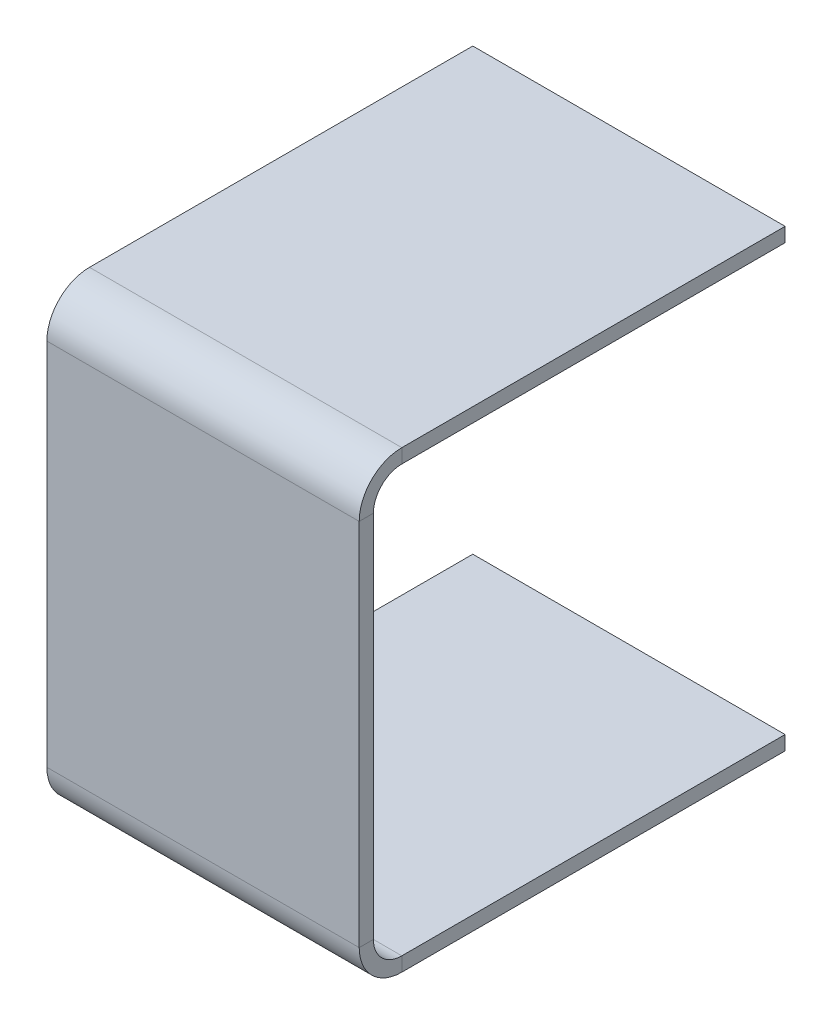
ISO-10303-21;
HEADER;
FILE_DESCRIPTION(('STEP AP214'),'2;1');
FILE_NAME('part.step','',(''),(''),'','','');
FILE_SCHEMA(('AUTOMOTIVE_DESIGN { 1 0 10303 214 1 1 1 1 }'));
ENDSEC;
DATA;
#1=APPLICATION_CONTEXT('core data for automotive mechanical design processes');
#2=APPLICATION_PROTOCOL_DEFINITION('international standard','automotive_design',2000,#1);
#3=PRODUCT_CONTEXT('',#1,'mechanical');
#4=PRODUCT('Part','Part','',(#3));
#5=PRODUCT_RELATED_PRODUCT_CATEGORY('part','',(#4));
#6=PRODUCT_DEFINITION_FORMATION('','',#4);
#7=PRODUCT_DEFINITION_CONTEXT('part definition',#1,'design');
#8=PRODUCT_DEFINITION('design','',#6,#7);
#9=PRODUCT_DEFINITION_SHAPE('','',#8);
#10=(LENGTH_UNIT() NAMED_UNIT(*) SI_UNIT(.MILLI.,.METRE.));
#11=(NAMED_UNIT(*) PLANE_ANGLE_UNIT() SI_UNIT($,.RADIAN.));
#12=(NAMED_UNIT(*) SI_UNIT($,.STERADIAN.) SOLID_ANGLE_UNIT());
#13=UNCERTAINTY_MEASURE_WITH_UNIT(LENGTH_MEASURE(1.E-05),#10,'distance_accuracy_value','');
#14=(GEOMETRIC_REPRESENTATION_CONTEXT(3) GLOBAL_UNCERTAINTY_ASSIGNED_CONTEXT((#13)) GLOBAL_UNIT_ASSIGNED_CONTEXT((#10,
#11,#12)) REPRESENTATION_CONTEXT('',''));
#15=CARTESIAN_POINT('',(0.,0.,0.));
#16=DIRECTION('',(0.,0.,1.));
#17=DIRECTION('',(1.,0.,0.));
#18=AXIS2_PLACEMENT_3D('',#15,#16,#17);
#19=CARTESIAN_POINT('',(0.,0.,0.));
#20=DIRECTION('',(0.,0.,-1.));
#21=DIRECTION('',(1.,0.,0.));
#22=AXIS2_PLACEMENT_3D('',#19,#20,#21);
#23=PLANE('',#22);
#24=DIRECTION('',(0.,-1.,0.));
#25=VECTOR('',#24,1.);
#26=CARTESIAN_POINT('',(11.,-16.,0.));
#27=LINE('',#26,#25);
#28=CARTESIAN_POINT('',(11.,-15.,0.));
#29=VERTEX_POINT('',#28);
#30=CARTESIAN_POINT('',(11.,-16.,0.));
#31=VERTEX_POINT('',#30);
#32=EDGE_CURVE('E154',#29,#31,#27,.T.);
#33=ORIENTED_EDGE('',*,*,#32,.T.);
#34=DIRECTION('',(-1.,0.,0.));
#35=VECTOR('',#34,1.);
#36=CARTESIAN_POINT('',(-11.,-16.,0.));
#37=LINE('',#36,#35);
#38=CARTESIAN_POINT('',(-11.,-16.,0.));
#39=VERTEX_POINT('',#38);
#40=EDGE_CURVE('E153',#31,#39,#37,.T.);
#41=ORIENTED_EDGE('',*,*,#40,.T.);
#42=DIRECTION('',(0.,1.,0.));
#43=VECTOR('',#42,1.);
#44=CARTESIAN_POINT('',(-11.,-16.,0.));
#45=LINE('',#44,#43);
#46=CARTESIAN_POINT('',(-11.,-15.,0.));
#47=VERTEX_POINT('',#46);
#48=EDGE_CURVE('E140',#39,#47,#45,.T.);
#49=ORIENTED_EDGE('',*,*,#48,.T.);
#50=DIRECTION('',(1.,0.,0.));
#51=VECTOR('',#50,1.);
#52=CARTESIAN_POINT('',(-11.,-15.,0.));
#53=LINE('',#52,#51);
#54=EDGE_CURVE('E150',#47,#29,#53,.T.);
#55=ORIENTED_EDGE('',*,*,#54,.T.);
#56=EDGE_LOOP('',(#33,#41,#49,#55));
#57=FACE_BOUND('',#56,.T.);
#58=ADVANCED_FACE('F32',(#57),#23,.T.);
#59=CARTESIAN_POINT('',(0.,0.,0.));
#60=DIRECTION('',(0.,0.,1.));
#61=DIRECTION('',(1.,0.,0.));
#62=AXIS2_PLACEMENT_3D('',#59,#60,#61);
#63=PLANE('',#62);
#64=DIRECTION('',(0.,1.,0.));
#65=VECTOR('',#64,1.);
#66=CARTESIAN_POINT('',(11.,16.,0.));
#67=LINE('',#66,#65);
#68=CARTESIAN_POINT('',(11.,15.,0.));
#69=VERTEX_POINT('',#68);
#70=CARTESIAN_POINT('',(11.,16.,0.));
#71=VERTEX_POINT('',#70);
#72=EDGE_CURVE('E46',#69,#71,#67,.T.);
#73=ORIENTED_EDGE('',*,*,#72,.F.);
#74=DIRECTION('',(1.,0.,0.));
#75=VECTOR('',#74,1.);
#76=CARTESIAN_POINT('',(-11.,15.,0.));
#77=LINE('',#76,#75);
#78=CARTESIAN_POINT('',(-11.,15.,0.));
#79=VERTEX_POINT('',#78);
#80=EDGE_CURVE('E55',#79,#69,#77,.T.);
#81=ORIENTED_EDGE('',*,*,#80,.F.);
#82=DIRECTION('',(0.,-1.,0.));
#83=VECTOR('',#82,1.);
#84=CARTESIAN_POINT('',(-11.,16.,0.));
#85=LINE('',#84,#83);
#86=CARTESIAN_POINT('',(-11.,16.,0.));
#87=VERTEX_POINT('',#86);
#88=EDGE_CURVE('E198',#87,#79,#85,.T.);
#89=ORIENTED_EDGE('',*,*,#88,.F.);
#90=DIRECTION('',(-1.,0.,0.));
#91=VECTOR('',#90,1.);
#92=CARTESIAN_POINT('',(-11.,16.,0.));
#93=LINE('',#92,#91);
#94=EDGE_CURVE('E11',#71,#87,#93,.T.);
#95=ORIENTED_EDGE('',*,*,#94,.F.);
#96=EDGE_LOOP('',(#73,#81,#89,#95));
#97=FACE_BOUND('',#96,.T.);
#98=ADVANCED_FACE('F302',(#97),#63,.F.);
#99=CARTESIAN_POINT('',(-11.,-16.,0.));
#100=DIRECTION('',(1.,0.,0.));
#101=DIRECTION('',(0.,0.,-1.));
#102=AXIS2_PLACEMENT_3D('',#99,#100,#101);
#103=PLANE('',#102);
#104=DIRECTION('',(0.,0.,1.));
#105=VECTOR('',#104,1.);
#106=CARTESIAN_POINT('',(-11.,-15.,0.));
#107=LINE('',#106,#105);
#108=CARTESIAN_POINT('',(-11.,-15.,27.));
#109=VERTEX_POINT('',#108);
#110=EDGE_CURVE('E147',#47,#109,#107,.T.);
#111=ORIENTED_EDGE('',*,*,#110,.F.);
#112=ORIENTED_EDGE('',*,*,#48,.F.);
#113=DIRECTION('',(0.,0.,1.));
#114=VECTOR('',#113,1.);
#115=CARTESIAN_POINT('',(-11.,-16.,0.));
#116=LINE('',#115,#114);
#117=CARTESIAN_POINT('',(-11.,-16.,27.));
#118=VERTEX_POINT('',#117);
#119=EDGE_CURVE('E145',#39,#118,#116,.T.);
#120=ORIENTED_EDGE('',*,*,#119,.T.);
#121=DIRECTION('',(0.,1.,0.));
#122=VECTOR('',#121,1.);
#123=CARTESIAN_POINT('',(-11.,-16.,27.));
#124=LINE('',#123,#122);
#125=EDGE_CURVE('E164',#118,#109,#124,.T.);
#126=ORIENTED_EDGE('',*,*,#125,.T.);
#127=EDGE_LOOP('',(#111,#112,#120,#126));
#128=FACE_BOUND('',#127,.T.);
#129=ADVANCED_FACE('F142',(#128),#103,.F.);
#130=CARTESIAN_POINT('',(-11.,-15.,0.));
#131=DIRECTION('',(0.,-1.,0.));
#132=DIRECTION('',(0.,0.,-1.));
#133=AXIS2_PLACEMENT_3D('',#130,#131,#132);
#134=PLANE('',#133);
#135=DIRECTION('',(0.,0.,1.));
#136=VECTOR('',#135,1.);
#137=CARTESIAN_POINT('',(11.,-15.,0.));
#138=LINE('',#137,#136);
#139=CARTESIAN_POINT('',(11.,-15.,27.));
#140=VERTEX_POINT('',#139);
#141=EDGE_CURVE('E209',#29,#140,#138,.T.);
#142=ORIENTED_EDGE('',*,*,#141,.F.);
#143=ORIENTED_EDGE('',*,*,#54,.F.);
#144=ORIENTED_EDGE('',*,*,#110,.T.);
#145=DIRECTION('',(1.,0.,0.));
#146=VECTOR('',#145,1.);
#147=CARTESIAN_POINT('',(-11.,-15.,27.));
#148=LINE('',#147,#146);
#149=EDGE_CURVE('E206',#109,#140,#148,.T.);
#150=ORIENTED_EDGE('',*,*,#149,.T.);
#151=EDGE_LOOP('',(#142,#143,#144,#150));
#152=FACE_BOUND('',#151,.T.);
#153=ADVANCED_FACE('F309',(#152),#134,.F.);
#154=CARTESIAN_POINT('',(11.,-16.,0.));
#155=DIRECTION('',(-1.,0.,0.));
#156=DIRECTION('',(0.,0.,1.));
#157=AXIS2_PLACEMENT_3D('',#154,#155,#156);
#158=PLANE('',#157);
#159=DIRECTION('',(0.,0.,1.));
#160=VECTOR('',#159,1.);
#161=CARTESIAN_POINT('',(11.,-16.,0.));
#162=LINE('',#161,#160);
#163=CARTESIAN_POINT('',(11.,-16.,27.));
#164=VERTEX_POINT('',#163);
#165=EDGE_CURVE('E233',#31,#164,#162,.T.);
#166=ORIENTED_EDGE('',*,*,#165,.F.);
#167=ORIENTED_EDGE('',*,*,#32,.F.);
#168=ORIENTED_EDGE('',*,*,#141,.T.);
#169=DIRECTION('',(0.,-1.,0.));
#170=VECTOR('',#169,1.);
#171=CARTESIAN_POINT('',(11.,-16.,27.));
#172=LINE('',#171,#170);
#173=EDGE_CURVE('E212',#140,#164,#172,.T.);
#174=ORIENTED_EDGE('',*,*,#173,.T.);
#175=EDGE_LOOP('',(#166,#167,#168,#174));
#176=FACE_BOUND('',#175,.T.);
#177=ADVANCED_FACE('F296',(#176),#158,.F.);
#178=CARTESIAN_POINT('',(-11.,-16.,0.));
#179=DIRECTION('',(0.,1.,0.));
#180=DIRECTION('',(0.,0.,1.));
#181=AXIS2_PLACEMENT_3D('',#178,#179,#180);
#182=PLANE('',#181);
#183=DIRECTION('',(-1.,0.,0.));
#184=VECTOR('',#183,1.);
#185=CARTESIAN_POINT('',(-11.,-16.,27.));
#186=LINE('',#185,#184);
#187=EDGE_CURVE('E162',#164,#118,#186,.T.);
#188=ORIENTED_EDGE('',*,*,#187,.T.);
#189=ORIENTED_EDGE('',*,*,#119,.F.);
#190=ORIENTED_EDGE('',*,*,#40,.F.);
#191=ORIENTED_EDGE('',*,*,#165,.T.);
#192=EDGE_LOOP('',(#188,#189,#190,#191));
#193=FACE_BOUND('',#192,.T.);
#194=ADVANCED_FACE('F160',(#193),#182,.F.);
#195=CARTESIAN_POINT('',(-11.,-16.,27.));
#196=DIRECTION('',(1.,0.,0.));
#197=DIRECTION('',(0.,0.,-1.));
#198=AXIS2_PLACEMENT_3D('',#195,#196,#197);
#199=PLANE('',#198);
#200=CARTESIAN_POINT('',(-11.,-13.,27.));
#201=DIRECTION('',(-1.,0.,0.));
#202=DIRECTION('',(0.,-1.,0.));
#203=AXIS2_PLACEMENT_3D('',#200,#201,#202);
#204=CIRCLE('',#203,2.);
#205=CARTESIAN_POINT('',(-11.,-13.,29.));
#206=VERTEX_POINT('',#205);
#207=EDGE_CURVE('E172',#109,#206,#204,.T.);
#208=ORIENTED_EDGE('',*,*,#207,.F.);
#209=ORIENTED_EDGE('',*,*,#125,.F.);
#210=CARTESIAN_POINT('',(-11.,-13.,27.));
#211=DIRECTION('',(-1.,0.,0.));
#212=DIRECTION('',(0.,-1.,0.));
#213=AXIS2_PLACEMENT_3D('',#210,#211,#212);
#214=CIRCLE('',#213,3.);
#215=CARTESIAN_POINT('',(-11.,-13.,30.));
#216=VERTEX_POINT('',#215);
#217=EDGE_CURVE('E173',#118,#216,#214,.T.);
#218=ORIENTED_EDGE('',*,*,#217,.T.);
#219=DIRECTION('',(0.,0.,-1.));
#220=VECTOR('',#219,1.);
#221=CARTESIAN_POINT('',(-11.,-13.,30.));
#222=LINE('',#221,#220);
#223=EDGE_CURVE('E169',#216,#206,#222,.T.);
#224=ORIENTED_EDGE('',*,*,#223,.T.);
#225=EDGE_LOOP('',(#208,#209,#218,#224));
#226=FACE_BOUND('',#225,.T.);
#227=ADVANCED_FACE('F295',(#226),#199,.F.);
#228=CARTESIAN_POINT('',(0.,-13.,27.));
#229=DIRECTION('',(-1.,0.,0.));
#230=DIRECTION('',(0.,0.,1.));
#231=AXIS2_PLACEMENT_3D('',#228,#229,#230);
#232=CYLINDRICAL_SURFACE('',#231,2.);
#233=CARTESIAN_POINT('',(11.,-13.,27.));
#234=DIRECTION('',(-1.,0.,0.));
#235=DIRECTION('',(0.,-1.,0.));
#236=AXIS2_PLACEMENT_3D('',#233,#234,#235);
#237=CIRCLE('',#236,2.);
#238=CARTESIAN_POINT('',(11.,-13.,29.));
#239=VERTEX_POINT('',#238);
#240=EDGE_CURVE('E215',#140,#239,#237,.T.);
#241=ORIENTED_EDGE('',*,*,#240,.F.);
#242=ORIENTED_EDGE('',*,*,#149,.F.);
#243=ORIENTED_EDGE('',*,*,#207,.T.);
#244=DIRECTION('',(1.,0.,0.));
#245=VECTOR('',#244,1.);
#246=CARTESIAN_POINT('',(-11.,-13.,29.));
#247=LINE('',#246,#245);
#248=EDGE_CURVE('E176',#206,#239,#247,.T.);
#249=ORIENTED_EDGE('',*,*,#248,.T.);
#250=EDGE_LOOP('',(#241,#242,#243,#249));
#251=FACE_BOUND('',#250,.T.);
#252=ADVANCED_FACE('F318',(#251),#232,.F.);
#253=CARTESIAN_POINT('',(11.,-16.,27.));
#254=DIRECTION('',(-1.,0.,0.));
#255=DIRECTION('',(0.,0.,1.));
#256=AXIS2_PLACEMENT_3D('',#253,#254,#255);
#257=PLANE('',#256);
#258=CARTESIAN_POINT('',(11.,-13.,27.));
#259=DIRECTION('',(-1.,0.,0.));
#260=DIRECTION('',(0.,-1.,0.));
#261=AXIS2_PLACEMENT_3D('',#258,#259,#260);
#262=CIRCLE('',#261,3.);
#263=CARTESIAN_POINT('',(11.,-13.,30.));
#264=VERTEX_POINT('',#263);
#265=EDGE_CURVE('E237',#164,#264,#262,.T.);
#266=ORIENTED_EDGE('',*,*,#265,.F.);
#267=ORIENTED_EDGE('',*,*,#173,.F.);
#268=ORIENTED_EDGE('',*,*,#240,.T.);
#269=DIRECTION('',(0.,0.,1.));
#270=VECTOR('',#269,1.);
#271=CARTESIAN_POINT('',(11.,-13.,30.));
#272=LINE('',#271,#270);
#273=EDGE_CURVE('E218',#239,#264,#272,.T.);
#274=ORIENTED_EDGE('',*,*,#273,.T.);
#275=EDGE_LOOP('',(#266,#267,#268,#274));
#276=FACE_BOUND('',#275,.T.);
#277=ADVANCED_FACE('F274',(#276),#257,.F.);
#278=CARTESIAN_POINT('',(0.,-13.,27.));
#279=DIRECTION('',(-1.,0.,0.));
#280=DIRECTION('',(0.,0.,1.));
#281=AXIS2_PLACEMENT_3D('',#278,#279,#280);
#282=CYLINDRICAL_SURFACE('',#281,3.);
#283=DIRECTION('',(-1.,0.,0.));
#284=VECTOR('',#283,1.);
#285=CARTESIAN_POINT('',(-11.,-13.,30.));
#286=LINE('',#285,#284);
#287=EDGE_CURVE('E189',#264,#216,#286,.T.);
#288=ORIENTED_EDGE('',*,*,#287,.T.);
#289=ORIENTED_EDGE('',*,*,#217,.F.);
#290=ORIENTED_EDGE('',*,*,#187,.F.);
#291=ORIENTED_EDGE('',*,*,#265,.T.);
#292=EDGE_LOOP('',(#288,#289,#290,#291));
#293=FACE_BOUND('',#292,.T.);
#294=ADVANCED_FACE('F270',(#293),#282,.T.);
#295=CARTESIAN_POINT('',(-11.,-13.,30.));
#296=DIRECTION('',(1.,0.,0.));
#297=DIRECTION('',(0.,0.,-1.));
#298=AXIS2_PLACEMENT_3D('',#295,#296,#297);
#299=PLANE('',#298);
#300=DIRECTION('',(0.,1.,0.));
#301=VECTOR('',#300,1.);
#302=CARTESIAN_POINT('',(-11.,-13.,29.));
#303=LINE('',#302,#301);
#304=CARTESIAN_POINT('',(-11.,13.,29.));
#305=VERTEX_POINT('',#304);
#306=EDGE_CURVE('E182',#206,#305,#303,.T.);
#307=ORIENTED_EDGE('',*,*,#306,.F.);
#308=ORIENTED_EDGE('',*,*,#223,.F.);
#309=DIRECTION('',(0.,1.,0.));
#310=VECTOR('',#309,1.);
#311=CARTESIAN_POINT('',(-11.,-13.,30.));
#312=LINE('',#311,#310);
#313=CARTESIAN_POINT('',(-11.,13.,30.));
#314=VERTEX_POINT('',#313);
#315=EDGE_CURVE('E183',#216,#314,#312,.T.);
#316=ORIENTED_EDGE('',*,*,#315,.T.);
#317=DIRECTION('',(0.,0.,-1.));
#318=VECTOR('',#317,1.);
#319=CARTESIAN_POINT('',(-11.,13.,30.));
#320=LINE('',#319,#318);
#321=EDGE_CURVE('E179',#314,#305,#320,.T.);
#322=ORIENTED_EDGE('',*,*,#321,.T.);
#323=EDGE_LOOP('',(#307,#308,#316,#322));
#324=FACE_BOUND('',#323,.T.);
#325=ADVANCED_FACE('F265',(#324),#299,.F.);
#326=CARTESIAN_POINT('',(-11.,-13.,29.));
#327=DIRECTION('',(0.,0.,1.));
#328=DIRECTION('',(1.,0.,0.));
#329=AXIS2_PLACEMENT_3D('',#326,#327,#328);
#330=PLANE('',#329);
#331=DIRECTION('',(0.,1.,0.));
#332=VECTOR('',#331,1.);
#333=CARTESIAN_POINT('',(11.,-13.,29.));
#334=LINE('',#333,#332);
#335=CARTESIAN_POINT('',(11.,13.,29.));
#336=VERTEX_POINT('',#335);
#337=EDGE_CURVE('E221',#239,#336,#334,.T.);
#338=ORIENTED_EDGE('',*,*,#337,.F.);
#339=ORIENTED_EDGE('',*,*,#248,.F.);
#340=ORIENTED_EDGE('',*,*,#306,.T.);
#341=DIRECTION('',(1.,0.,0.));
#342=VECTOR('',#341,1.);
#343=CARTESIAN_POINT('',(-11.,13.,29.));
#344=LINE('',#343,#342);
#345=EDGE_CURVE('E186',#305,#336,#344,.T.);
#346=ORIENTED_EDGE('',*,*,#345,.T.);
#347=EDGE_LOOP('',(#338,#339,#340,#346));
#348=FACE_BOUND('',#347,.T.);
#349=ADVANCED_FACE('F315',(#348),#330,.F.);
#350=CARTESIAN_POINT('',(11.,-13.,30.));
#351=DIRECTION('',(-1.,0.,0.));
#352=DIRECTION('',(0.,0.,1.));
#353=AXIS2_PLACEMENT_3D('',#350,#351,#352);
#354=PLANE('',#353);
#355=DIRECTION('',(0.,1.,0.));
#356=VECTOR('',#355,1.);
#357=CARTESIAN_POINT('',(11.,-13.,30.));
#358=LINE('',#357,#356);
#359=CARTESIAN_POINT('',(11.,13.,30.));
#360=VERTEX_POINT('',#359);
#361=EDGE_CURVE('E242',#264,#360,#358,.T.);
#362=ORIENTED_EDGE('',*,*,#361,.F.);
#363=ORIENTED_EDGE('',*,*,#273,.F.);
#364=ORIENTED_EDGE('',*,*,#337,.T.);
#365=DIRECTION('',(0.,0.,1.));
#366=VECTOR('',#365,1.);
#367=CARTESIAN_POINT('',(11.,13.,30.));
#368=LINE('',#367,#366);
#369=EDGE_CURVE('E224',#336,#360,#368,.T.);
#370=ORIENTED_EDGE('',*,*,#369,.T.);
#371=EDGE_LOOP('',(#362,#363,#364,#370));
#372=FACE_BOUND('',#371,.T.);
#373=ADVANCED_FACE('F276',(#372),#354,.F.);
#374=CARTESIAN_POINT('',(-11.,-13.,30.));
#375=DIRECTION('',(0.,0.,-1.));
#376=DIRECTION('',(-1.,0.,0.));
#377=AXIS2_PLACEMENT_3D('',#374,#375,#376);
#378=PLANE('',#377);
#379=DIRECTION('',(-1.,0.,0.));
#380=VECTOR('',#379,1.);
#381=CARTESIAN_POINT('',(-11.,13.,30.));
#382=LINE('',#381,#380);
#383=EDGE_CURVE('E197',#360,#314,#382,.T.);
#384=ORIENTED_EDGE('',*,*,#383,.T.);
#385=ORIENTED_EDGE('',*,*,#315,.F.);
#386=ORIENTED_EDGE('',*,*,#287,.F.);
#387=ORIENTED_EDGE('',*,*,#361,.T.);
#388=EDGE_LOOP('',(#384,#385,#386,#387));
#389=FACE_BOUND('',#388,.T.);
#390=ADVANCED_FACE('F268',(#389),#378,.F.);
#391=CARTESIAN_POINT('',(-11.,13.,30.));
#392=DIRECTION('',(1.,0.,0.));
#393=DIRECTION('',(0.,0.,-1.));
#394=AXIS2_PLACEMENT_3D('',#391,#392,#393);
#395=PLANE('',#394);
#396=CARTESIAN_POINT('',(-11.,13.,27.));
#397=DIRECTION('',(-1.,0.,0.));
#398=DIRECTION('',(0.,0.,1.));
#399=AXIS2_PLACEMENT_3D('',#396,#397,#398);
#400=CIRCLE('',#399,2.);
#401=CARTESIAN_POINT('',(-11.,15.,27.));
#402=VERTEX_POINT('',#401);
#403=EDGE_CURVE('E120',#305,#402,#400,.T.);
#404=ORIENTED_EDGE('',*,*,#403,.F.);
#405=ORIENTED_EDGE('',*,*,#321,.F.);
#406=CARTESIAN_POINT('',(-11.,13.,27.));
#407=DIRECTION('',(-1.,0.,0.));
#408=DIRECTION('',(0.,0.,1.));
#409=AXIS2_PLACEMENT_3D('',#406,#407,#408);
#410=CIRCLE('',#409,3.);
#411=CARTESIAN_POINT('',(-11.,16.,27.));
#412=VERTEX_POINT('',#411);
#413=EDGE_CURVE('E192',#314,#412,#410,.T.);
#414=ORIENTED_EDGE('',*,*,#413,.T.);
#415=DIRECTION('',(0.,-1.,0.));
#416=VECTOR('',#415,1.);
#417=CARTESIAN_POINT('',(-11.,16.,27.));
#418=LINE('',#417,#416);
#419=EDGE_CURVE('E190',#412,#402,#418,.T.);
#420=ORIENTED_EDGE('',*,*,#419,.T.);
#421=EDGE_LOOP('',(#404,#405,#414,#420));
#422=FACE_BOUND('',#421,.T.);
#423=ADVANCED_FACE('F262',(#422),#395,.F.);
#424=CARTESIAN_POINT('',(0.,13.,27.));
#425=DIRECTION('',(-1.,0.,0.));
#426=DIRECTION('',(0.,0.,1.));
#427=AXIS2_PLACEMENT_3D('',#424,#425,#426);
#428=CYLINDRICAL_SURFACE('',#427,2.);
#429=CARTESIAN_POINT('',(11.,13.,27.));
#430=DIRECTION('',(-1.,0.,0.));
#431=DIRECTION('',(0.,0.,1.));
#432=AXIS2_PLACEMENT_3D('',#429,#430,#431);
#433=CIRCLE('',#432,2.);
#434=CARTESIAN_POINT('',(11.,15.,27.));
#435=VERTEX_POINT('',#434);
#436=EDGE_CURVE('E113',#336,#435,#433,.T.);
#437=ORIENTED_EDGE('',*,*,#436,.F.);
#438=ORIENTED_EDGE('',*,*,#345,.F.);
#439=ORIENTED_EDGE('',*,*,#403,.T.);
#440=DIRECTION('',(1.,0.,0.));
#441=VECTOR('',#440,1.);
#442=CARTESIAN_POINT('',(-11.,15.,27.));
#443=LINE('',#442,#441);
#444=EDGE_CURVE('E194',#402,#435,#443,.T.);
#445=ORIENTED_EDGE('',*,*,#444,.T.);
#446=EDGE_LOOP('',(#437,#438,#439,#445));
#447=FACE_BOUND('',#446,.T.);
#448=ADVANCED_FACE('F312',(#447),#428,.F.);
#449=CARTESIAN_POINT('',(11.,13.,30.));
#450=DIRECTION('',(-1.,0.,0.));
#451=DIRECTION('',(0.,0.,1.));
#452=AXIS2_PLACEMENT_3D('',#449,#450,#451);
#453=PLANE('',#452);
#454=CARTESIAN_POINT('',(11.,13.,27.));
#455=DIRECTION('',(-1.,0.,0.));
#456=DIRECTION('',(0.,0.,1.));
#457=AXIS2_PLACEMENT_3D('',#454,#455,#456);
#458=CIRCLE('',#457,3.);
#459=CARTESIAN_POINT('',(11.,16.,27.));
#460=VERTEX_POINT('',#459);
#461=EDGE_CURVE('E247',#360,#460,#458,.T.);
#462=ORIENTED_EDGE('',*,*,#461,.F.);
#463=ORIENTED_EDGE('',*,*,#369,.F.);
#464=ORIENTED_EDGE('',*,*,#436,.T.);
#465=DIRECTION('',(0.,1.,0.));
#466=VECTOR('',#465,1.);
#467=CARTESIAN_POINT('',(11.,16.,27.));
#468=LINE('',#467,#466);
#469=EDGE_CURVE('E227',#435,#460,#468,.T.);
#470=ORIENTED_EDGE('',*,*,#469,.T.);
#471=EDGE_LOOP('',(#462,#463,#464,#470));
#472=FACE_BOUND('',#471,.T.);
#473=ADVANCED_FACE('F278',(#472),#453,.F.);
#474=CARTESIAN_POINT('',(0.,13.,27.));
#475=DIRECTION('',(-1.,0.,0.));
#476=DIRECTION('',(0.,0.,1.));
#477=AXIS2_PLACEMENT_3D('',#474,#475,#476);
#478=CYLINDRICAL_SURFACE('',#477,3.);
#479=DIRECTION('',(-1.,0.,0.));
#480=VECTOR('',#479,1.);
#481=CARTESIAN_POINT('',(-11.,16.,27.));
#482=LINE('',#481,#480);
#483=EDGE_CURVE('E204',#460,#412,#482,.T.);
#484=ORIENTED_EDGE('',*,*,#483,.T.);
#485=ORIENTED_EDGE('',*,*,#413,.F.);
#486=ORIENTED_EDGE('',*,*,#383,.F.);
#487=ORIENTED_EDGE('',*,*,#461,.T.);
#488=EDGE_LOOP('',(#484,#485,#486,#487));
#489=FACE_BOUND('',#488,.T.);
#490=ADVANCED_FACE('F258',(#489),#478,.T.);
#491=CARTESIAN_POINT('',(-11.,16.,27.));
#492=DIRECTION('',(1.,0.,0.));
#493=DIRECTION('',(0.,0.,-1.));
#494=AXIS2_PLACEMENT_3D('',#491,#492,#493);
#495=PLANE('',#494);
#496=DIRECTION('',(0.,0.,-1.));
#497=VECTOR('',#496,1.);
#498=CARTESIAN_POINT('',(-11.,15.,27.));
#499=LINE('',#498,#497);
#500=EDGE_CURVE('E94',#402,#79,#499,.T.);
#501=ORIENTED_EDGE('',*,*,#500,.F.);
#502=ORIENTED_EDGE('',*,*,#419,.F.);
#503=DIRECTION('',(0.,0.,-1.));
#504=VECTOR('',#503,1.);
#505=CARTESIAN_POINT('',(-11.,16.,27.));
#506=LINE('',#505,#504);
#507=EDGE_CURVE('E200',#412,#87,#506,.T.);
#508=ORIENTED_EDGE('',*,*,#507,.T.);
#509=ORIENTED_EDGE('',*,*,#88,.T.);
#510=EDGE_LOOP('',(#501,#502,#508,#509));
#511=FACE_BOUND('',#510,.T.);
#512=ADVANCED_FACE('F261',(#511),#495,.F.);
#513=CARTESIAN_POINT('',(-11.,15.,27.));
#514=DIRECTION('',(0.,1.,0.));
#515=DIRECTION('',(0.,0.,1.));
#516=AXIS2_PLACEMENT_3D('',#513,#514,#515);
#517=PLANE('',#516);
#518=DIRECTION('',(0.,0.,-1.));
#519=VECTOR('',#518,1.);
#520=CARTESIAN_POINT('',(11.,15.,27.));
#521=LINE('',#520,#519);
#522=EDGE_CURVE('E89',#435,#69,#521,.T.);
#523=ORIENTED_EDGE('',*,*,#522,.F.);
#524=ORIENTED_EDGE('',*,*,#444,.F.);
#525=ORIENTED_EDGE('',*,*,#500,.T.);
#526=ORIENTED_EDGE('',*,*,#80,.T.);
#527=EDGE_LOOP('',(#523,#524,#525,#526));
#528=FACE_BOUND('',#527,.T.);
#529=ADVANCED_FACE('F282',(#528),#517,.F.);
#530=CARTESIAN_POINT('',(11.,16.,27.));
#531=DIRECTION('',(-1.,0.,0.));
#532=DIRECTION('',(0.,0.,1.));
#533=AXIS2_PLACEMENT_3D('',#530,#531,#532);
#534=PLANE('',#533);
#535=DIRECTION('',(0.,0.,-1.));
#536=VECTOR('',#535,1.);
#537=CARTESIAN_POINT('',(11.,16.,27.));
#538=LINE('',#537,#536);
#539=EDGE_CURVE('E39',#460,#71,#538,.T.);
#540=ORIENTED_EDGE('',*,*,#539,.F.);
#541=ORIENTED_EDGE('',*,*,#469,.F.);
#542=ORIENTED_EDGE('',*,*,#522,.T.);
#543=ORIENTED_EDGE('',*,*,#72,.T.);
#544=EDGE_LOOP('',(#540,#541,#542,#543));
#545=FACE_BOUND('',#544,.T.);
#546=ADVANCED_FACE('F279',(#545),#534,.F.);
#547=CARTESIAN_POINT('',(-11.,16.,27.));
#548=DIRECTION('',(0.,-1.,0.));
#549=DIRECTION('',(0.,0.,-1.));
#550=AXIS2_PLACEMENT_3D('',#547,#548,#549);
#551=PLANE('',#550);
#552=ORIENTED_EDGE('',*,*,#94,.T.);
#553=ORIENTED_EDGE('',*,*,#507,.F.);
#554=ORIENTED_EDGE('',*,*,#483,.F.);
#555=ORIENTED_EDGE('',*,*,#539,.T.);
#556=EDGE_LOOP('',(#552,#553,#554,#555));
#557=FACE_BOUND('',#556,.T.);
#558=ADVANCED_FACE('F281',(#557),#551,.F.);
#559=CLOSED_SHELL('',(#58,#98,#129,#153,#177,#194,#227,#252,#277,#294,#325,#349,#373,#390,#423,
#448,#473,#490,#512,#529,#546,#558));
#560=MANIFOLD_SOLID_BREP('B2',#559);
#561=ADVANCED_BREP_SHAPE_REPRESENTATION('',(#18,#560),#14);
#562=SHAPE_DEFINITION_REPRESENTATION(#9,#561);
ENDSEC;
END-ISO-10303-21;
